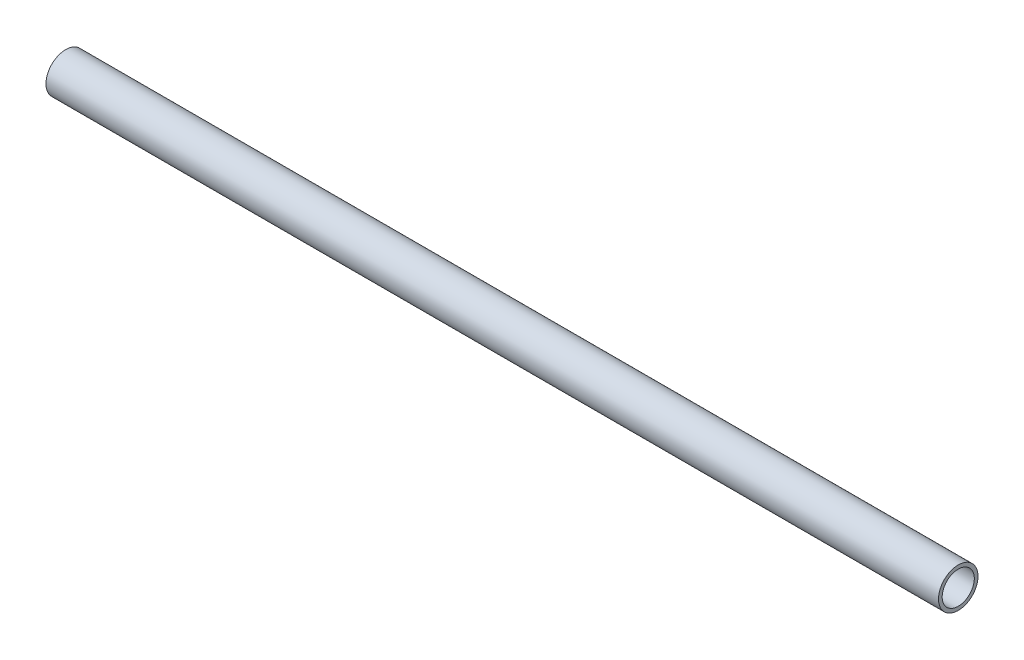
ISO-10303-21;
HEADER;
FILE_DESCRIPTION(('STEP AP214'),'2;1');
FILE_NAME('part.step','',(''),(''),'','','');
FILE_SCHEMA(('AUTOMOTIVE_DESIGN { 1 0 10303 214 1 1 1 1 }'));
ENDSEC;
DATA;
#1=APPLICATION_CONTEXT('core data for automotive mechanical design processes');
#2=APPLICATION_PROTOCOL_DEFINITION('international standard','automotive_design',2000,#1);
#3=PRODUCT_CONTEXT('',#1,'mechanical');
#4=PRODUCT('Part','Part','',(#3));
#5=PRODUCT_RELATED_PRODUCT_CATEGORY('part','',(#4));
#6=PRODUCT_DEFINITION_FORMATION('','',#4);
#7=PRODUCT_DEFINITION_CONTEXT('part definition',#1,'design');
#8=PRODUCT_DEFINITION('design','',#6,#7);
#9=PRODUCT_DEFINITION_SHAPE('','',#8);
#10=(LENGTH_UNIT() NAMED_UNIT(*) SI_UNIT(.MILLI.,.METRE.));
#11=(NAMED_UNIT(*) PLANE_ANGLE_UNIT() SI_UNIT($,.RADIAN.));
#12=(NAMED_UNIT(*) SI_UNIT($,.STERADIAN.) SOLID_ANGLE_UNIT());
#13=UNCERTAINTY_MEASURE_WITH_UNIT(LENGTH_MEASURE(1.E-05),#10,'distance_accuracy_value','');
#14=(GEOMETRIC_REPRESENTATION_CONTEXT(3) GLOBAL_UNCERTAINTY_ASSIGNED_CONTEXT((#13)) GLOBAL_UNIT_ASSIGNED_CONTEXT((#10,
#11,#12)) REPRESENTATION_CONTEXT('',''));
#15=CARTESIAN_POINT('',(0.,0.,0.));
#16=DIRECTION('',(0.,0.,1.));
#17=DIRECTION('',(1.,0.,0.));
#18=AXIS2_PLACEMENT_3D('',#15,#16,#17);
#19=CARTESIAN_POINT('',(358.775,0.,0.));
#20=DIRECTION('',(-1.,0.,0.));
#21=DIRECTION('',(0.,0.,1.));
#22=AXIS2_PLACEMENT_3D('',#19,#20,#21);
#23=CYLINDRICAL_SURFACE('',#22,6.4643);
#24=CARTESIAN_POINT('',(358.775,0.,0.));
#25=DIRECTION('',(1.,0.,0.));
#26=DIRECTION('',(0.,0.,-1.));
#27=AXIS2_PLACEMENT_3D('',#24,#25,#26);
#28=CIRCLE('',#27,6.4643);
#29=CARTESIAN_POINT('',(358.775,0.,-6.4643));
#30=VERTEX_POINT('',#29);
#31=EDGE_CURVE('E45',#30,#30,#28,.T.);
#32=ORIENTED_EDGE('',*,*,#31,.T.);
#33=EDGE_LOOP('',(#32));
#34=FACE_BOUND('',#33,.T.);
#35=CARTESIAN_POINT('',(0.,0.,0.));
#36=DIRECTION('',(1.,0.,0.));
#37=DIRECTION('',(0.,0.,-1.));
#38=AXIS2_PLACEMENT_3D('',#35,#36,#37);
#39=CIRCLE('',#38,6.4643);
#40=CARTESIAN_POINT('',(0.,0.,-6.4643));
#41=VERTEX_POINT('',#40);
#42=EDGE_CURVE('E51',#41,#41,#39,.T.);
#43=ORIENTED_EDGE('',*,*,#42,.F.);
#44=EDGE_LOOP('',(#43));
#45=FACE_BOUND('',#44,.T.);
#46=ADVANCED_FACE('F38',(#34,#45),#23,.F.);
#47=CARTESIAN_POINT('',(358.775,0.,0.));
#48=DIRECTION('',(-1.,0.,0.));
#49=DIRECTION('',(0.,0.,1.));
#50=AXIS2_PLACEMENT_3D('',#47,#48,#49);
#51=CYLINDRICAL_SURFACE('',#50,7.9375);
#52=CARTESIAN_POINT('',(358.775,0.,0.));
#53=DIRECTION('',(1.,0.,0.));
#54=DIRECTION('',(0.,0.,-1.));
#55=AXIS2_PLACEMENT_3D('',#52,#53,#54);
#56=CIRCLE('',#55,7.9375);
#57=CARTESIAN_POINT('',(358.775,0.,-7.9375));
#58=VERTEX_POINT('',#57);
#59=EDGE_CURVE('E11',#58,#58,#56,.T.);
#60=ORIENTED_EDGE('',*,*,#59,.F.);
#61=EDGE_LOOP('',(#60));
#62=FACE_BOUND('',#61,.T.);
#63=CARTESIAN_POINT('',(0.,0.,0.));
#64=DIRECTION('',(1.,0.,0.));
#65=DIRECTION('',(0.,0.,-1.));
#66=AXIS2_PLACEMENT_3D('',#63,#64,#65);
#67=CIRCLE('',#66,7.9375);
#68=CARTESIAN_POINT('',(0.,0.,-7.9375));
#69=VERTEX_POINT('',#68);
#70=EDGE_CURVE('E41',#69,#69,#67,.T.);
#71=ORIENTED_EDGE('',*,*,#70,.T.);
#72=EDGE_LOOP('',(#71));
#73=FACE_BOUND('',#72,.T.);
#74=ADVANCED_FACE('F58',(#62,#73),#51,.T.);
#75=CARTESIAN_POINT('',(358.775,0.,0.));
#76=DIRECTION('',(1.,0.,0.));
#77=DIRECTION('',(0.,0.,-1.));
#78=AXIS2_PLACEMENT_3D('',#75,#76,#77);
#79=PLANE('',#78);
#80=ORIENTED_EDGE('',*,*,#31,.F.);
#81=EDGE_LOOP('',(#80));
#82=FACE_BOUND('',#81,.T.);
#83=ORIENTED_EDGE('',*,*,#59,.T.);
#84=EDGE_LOOP('',(#83));
#85=FACE_BOUND('',#84,.T.);
#86=ADVANCED_FACE('F62',(#82,#85),#79,.T.);
#87=CARTESIAN_POINT('',(0.,0.,0.));
#88=DIRECTION('',(1.,0.,0.));
#89=DIRECTION('',(0.,0.,-1.));
#90=AXIS2_PLACEMENT_3D('',#87,#88,#89);
#91=PLANE('',#90);
#92=ORIENTED_EDGE('',*,*,#42,.T.);
#93=EDGE_LOOP('',(#92));
#94=FACE_BOUND('',#93,.T.);
#95=ORIENTED_EDGE('',*,*,#70,.F.);
#96=EDGE_LOOP('',(#95));
#97=FACE_BOUND('',#96,.T.);
#98=ADVANCED_FACE('F60',(#94,#97),#91,.F.);
#99=CLOSED_SHELL('',(#46,#74,#86,#98));
#100=MANIFOLD_SOLID_BREP('B2',#99);
#101=ADVANCED_BREP_SHAPE_REPRESENTATION('',(#18,#100),#14);
#102=SHAPE_DEFINITION_REPRESENTATION(#9,#101);
ENDSEC;
END-ISO-10303-21;
